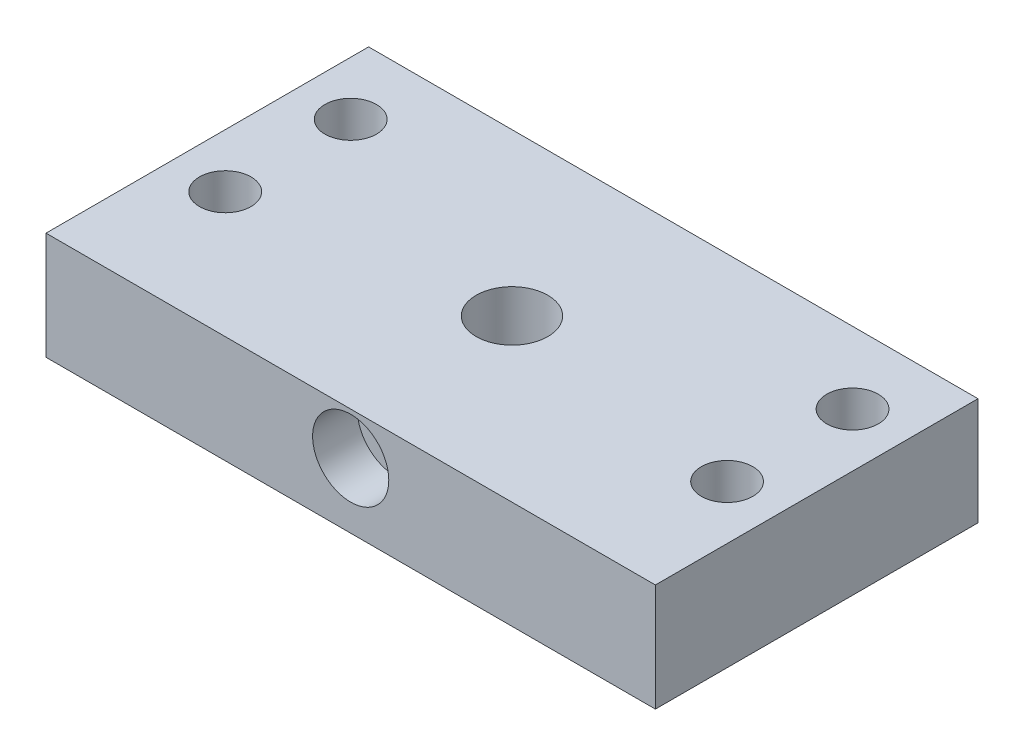
ISO-10303-21;
HEADER;
FILE_DESCRIPTION(('STEP AP214'),'2;1');
FILE_NAME('part.step','',(''),(''),'','','');
FILE_SCHEMA(('AUTOMOTIVE_DESIGN { 1 0 10303 214 1 1 1 1 }'));
ENDSEC;
DATA;
#1=APPLICATION_CONTEXT('core data for automotive mechanical design processes');
#2=APPLICATION_PROTOCOL_DEFINITION('international standard','automotive_design',2000,#1);
#3=PRODUCT_CONTEXT('',#1,'mechanical');
#4=PRODUCT('Part','Part','',(#3));
#5=PRODUCT_RELATED_PRODUCT_CATEGORY('part','',(#4));
#6=PRODUCT_DEFINITION_FORMATION('','',#4);
#7=PRODUCT_DEFINITION_CONTEXT('part definition',#1,'design');
#8=PRODUCT_DEFINITION('design','',#6,#7);
#9=PRODUCT_DEFINITION_SHAPE('','',#8);
#10=(LENGTH_UNIT() NAMED_UNIT(*) SI_UNIT(.MILLI.,.METRE.));
#11=(NAMED_UNIT(*) PLANE_ANGLE_UNIT() SI_UNIT($,.RADIAN.));
#12=(NAMED_UNIT(*) SI_UNIT($,.STERADIAN.) SOLID_ANGLE_UNIT());
#13=UNCERTAINTY_MEASURE_WITH_UNIT(LENGTH_MEASURE(1.E-05),#10,'distance_accuracy_value','');
#14=(GEOMETRIC_REPRESENTATION_CONTEXT(3) GLOBAL_UNCERTAINTY_ASSIGNED_CONTEXT((#13)) GLOBAL_UNIT_ASSIGNED_CONTEXT((#10,
#11,#12)) REPRESENTATION_CONTEXT('',''));
#15=CARTESIAN_POINT('',(0.,0.,0.));
#16=DIRECTION('',(0.,0.,1.));
#17=DIRECTION('',(1.,0.,0.));
#18=AXIS2_PLACEMENT_3D('',#15,#16,#17);
#19=CARTESIAN_POINT('',(0.,7.25,-18.001));
#20=DIRECTION('',(0.,0.,1.));
#21=DIRECTION('',(1.,0.,0.));
#22=AXIS2_PLACEMENT_3D('',#19,#20,#21);
#23=CYLINDRICAL_SURFACE('',#22,2.375);
#24=CARTESIAN_POINT('',(2.375,7.25,3.21859829739593));
#25=CARTESIAN_POINT('',(2.37500399921893,7.13019269672055,3.21859274203493));
#26=CARTESIAN_POINT('',(2.36587916323024,7.01040546905748,3.22538771653776));
#27=CARTESIAN_POINT('',(2.33003608146432,6.77483578789484,3.25136918584233));
#28=CARTESIAN_POINT('',(2.30329972694586,6.65905758571992,3.27056843473602));
#29=CARTESIAN_POINT('',(2.23399044613364,6.43541822919312,3.31828566284373));
#30=CARTESIAN_POINT('',(2.19152909658383,6.32750755769919,3.34673781872815));
#31=CARTESIAN_POINT('',(2.09232949271277,6.12040677269594,3.40963366185724));
#32=CARTESIAN_POINT('',(2.03558681798399,6.02121937209587,3.44407920317544));
#33=CARTESIAN_POINT('',(1.90153009389591,5.82137690949876,3.52005631808132));
#34=CARTESIAN_POINT('',(1.82256840644108,5.72196179983823,3.5619428373468));
#35=CARTESIAN_POINT('',(1.64969504355961,5.53675966426523,3.64523320979023));
#36=CARTESIAN_POINT('',(1.55577253548869,5.45098260383914,3.68663668972149));
#37=CARTESIAN_POINT('',(1.34367485162625,5.28658721904273,3.76945679722964));
#38=CARTESIAN_POINT('',(1.22398860493031,5.20966645665209,3.81041826206638));
#39=CARTESIAN_POINT('',(0.970479402420635,5.07763722656182,3.88271570681444));
#40=CARTESIAN_POINT('',(0.836669263450686,5.02250919484508,3.91406031439345));
#41=CARTESIAN_POINT('',(0.571987570331598,4.94115171626473,3.96095464121703));
#42=CARTESIAN_POINT('',(0.442020032298662,4.91269466982756,3.97771118078781));
#43=CARTESIAN_POINT('',(0.178184244819338,4.87796920586672,3.99821176000784));
#44=CARTESIAN_POINT('',(0.0443196737403946,4.87168050740931,4.00196769333412));
#45=CARTESIAN_POINT('',(-0.20597385257549,4.8810442937401,3.99641448212983));
#46=CARTESIAN_POINT('',(-0.322545044730626,4.89412369499521,3.98863733729226));
#47=CARTESIAN_POINT('',(-0.551483940371612,4.93698207474324,3.96347391279008));
#48=CARTESIAN_POINT('',(-0.663851332351829,4.96676228817814,3.94608692252657));
#49=CARTESIAN_POINT('',(-0.882347185133233,5.04193824704594,3.90307041352531));
#50=CARTESIAN_POINT('',(-0.98843009675314,5.08743472665091,3.87738779425803));
#51=CARTESIAN_POINT('',(-1.1915967959663,5.19237774738527,3.81985085065154));
#52=CARTESIAN_POINT('',(-1.28867816568337,5.25182802154397,3.78799487516567));
#53=CARTESIAN_POINT('',(-1.48337363486101,5.39091807141468,3.71639460765003));
#54=CARTESIAN_POINT('',(-1.57969649287139,5.47211306649521,3.6761630184736));
#55=CARTESIAN_POINT('',(-1.75816707389297,5.64836524176809,3.59423359110488));
#56=CARTESIAN_POINT('',(-1.84029570284407,5.74344078193277,3.55253386730505));
#57=CARTESIAN_POINT('',(-1.99735001326313,5.95742079208189,3.46690790060612));
#58=CARTESIAN_POINT('',(-2.07043180286397,6.07780215349926,3.42325729898975));
#59=CARTESIAN_POINT('',(-2.19490642645885,6.33188923753022,3.34482142789895));
#60=CARTESIAN_POINT('',(-2.24633900478084,6.46556998171544,3.3100199598304));
#61=CARTESIAN_POINT('',(-2.31514079416325,6.70905080291436,3.26212076962811));
#62=CARTESIAN_POINT('',(-2.33775606816076,6.81673415984444,3.2458010171099));
#63=CARTESIAN_POINT('',(-2.36783056608336,7.03522687932263,3.22393270128734));
#64=CARTESIAN_POINT('',(-2.37530669862908,7.14603261408898,3.21837212157576));
#65=CARTESIAN_POINT('',(-2.37467345051733,7.36770087015217,3.21883912092991));
#66=CARTESIAN_POINT('',(-2.36654550170154,7.47856330196957,3.22488050581689));
#67=CARTESIAN_POINT('',(-2.33516575464101,7.69701888440702,3.24767009167096));
#68=CARTESIAN_POINT('',(-2.31190218915793,7.80460942310127,3.26442662299236));
#69=CARTESIAN_POINT('',(-2.25135151160707,8.01418387832866,3.30647252374685));
#70=CARTESIAN_POINT('',(-2.21403521973313,8.11615561913966,3.33177963673067));
#71=CARTESIAN_POINT('',(-2.12668668997642,8.3127387051287,3.38820052053147));
#72=CARTESIAN_POINT('',(-2.0766495711049,8.4073472067865,3.41931651900089));
#73=CARTESIAN_POINT('',(-1.95503621600254,8.60429875500901,3.49050531762543));
#74=CARTESIAN_POINT('',(-1.88121366890389,8.70503666116637,3.53118782259871));
#75=CARTESIAN_POINT('',(-1.71881564621432,8.89371937289048,3.61302584821871));
#76=CARTESIAN_POINT('',(-1.63022643115858,8.98165211994554,3.6541817758414));
#77=CARTESIAN_POINT('',(-1.42774937279771,9.15311292773089,3.73831045191109));
#78=CARTESIAN_POINT('',(-1.31208997910011,9.23476824317186,3.78088381887895));
#79=CARTESIAN_POINT('',(-1.06594140172161,9.37710077352837,3.85750389130317));
#80=CARTESIAN_POINT('',(-0.935462670333445,9.4377926536535,3.89155655290147));
#81=CARTESIAN_POINT('',(-0.673461271000761,9.53143356169658,3.94499073924787));
#82=CARTESIAN_POINT('',(-0.542753057087998,9.5661239131019,3.9652820798713));
#83=CARTESIAN_POINT('',(-0.276041317654081,9.61277295252532,3.99270610285033));
#84=CARTESIAN_POINT('',(-0.140043639752832,9.62475605369247,3.99985291698113));
#85=CARTESIAN_POINT('',(0.11428081976659,9.62520580674378,4.00012414727652));
#86=CARTESIAN_POINT('',(0.232612825204316,9.61651971608736,3.99494630163883));
#87=CARTESIAN_POINT('',(0.465804396706108,9.58185376675745,3.97450872268908));
#88=CARTESIAN_POINT('',(0.580663886631354,9.55587352917737,3.95924876848283));
#89=CARTESIAN_POINT('',(0.802570773351388,9.48826152682534,3.9202603013208));
#90=CARTESIAN_POINT('',(0.909694426450307,9.4468182800975,3.89663395752156));
#91=CARTESIAN_POINT('',(1.11551347833263,9.34981213784586,3.84278029354569));
#92=CARTESIAN_POINT('',(1.21420690422523,9.29424594921894,3.81255143406548));
#93=CARTESIAN_POINT('',(1.41197270878366,9.16376263421425,3.74412094514629));
#94=CARTESIAN_POINT('',(1.50990963173195,9.08739500797667,3.70540916048651));
#95=CARTESIAN_POINT('',(1.69235100288208,8.92088475241084,3.62572491802193));
#96=CARTESIAN_POINT('',(1.77683990172037,8.83072641021238,3.58474991601283));
#97=CARTESIAN_POINT('',(1.94054997146781,8.62625528073629,3.49911361847173));
#98=CARTESIAN_POINT('',(2.01786624821418,8.51033717977594,3.45461361348632));
#99=CARTESIAN_POINT('',(2.15183027799257,8.26477401369631,3.37280396876143));
#100=CARTESIAN_POINT('',(2.2084946788526,8.13514011438158,3.33548854890452));
#101=CARTESIAN_POINT('',(2.29307696478757,7.88098795254745,3.2778228551022));
#102=CARTESIAN_POINT('',(2.32361169112555,7.75769403019723,3.25598298398031));
#103=CARTESIAN_POINT('',(2.36455269660588,7.50625288753691,3.22638653027499));
#104=CARTESIAN_POINT('',(2.37499572346775,7.37811496561476,3.21860423797605));
#105=CARTESIAN_POINT('',(2.375,7.25,3.21859829739593));
#106=B_SPLINE_CURVE_WITH_KNOTS('',3,(#24,#25,#26,#27,#28,#29,#30,#31,#32,#33,#34,#35,#36,#37,
#38,#39,#40,#41,#42,#43,#44,#45,#46,#47,#48,#49,#50,#51,#52,#53,#54,#55,#56,#57,#58,#59,#60,#61,
#62,#63,#64,#65,#66,#67,#68,#69,#70,#71,#72,#73,#74,#75,#76,#77,#78,#79,#80,#81,#82,#83,#84,#85,
#86,#87,#88,#89,#90,#91,#92,#93,#94,#95,#96,#97,#98,#99,#100,#101,#102,#103,#104,#105),
.UNSPECIFIED.,.T.,.F.,(4,2,2,2,2,2,2,2,2,2,2,2,2,2,2,2,2,2,2,2,2,2,2,2,2,2,2,2,2,2,2,2,2,2,2,2,
2,2,2,2,4),(0.,0.358885040976135,0.718139676564717,1.07489259104103,1.43175606506433,
1.83124734109027,2.2310292017523,2.67279137544207,3.11415605983443,3.51407427068365,
3.91362651728914,4.26463189155495,4.615663224345,4.96898758947828,5.32240658669213,
5.71756600452525,6.11325292146195,6.55336395272599,6.99266345219662,7.32493567633687,
7.65683658677772,7.98913268925771,8.32168744571811,8.65493657804029,8.98831377174795,
9.3808301079571,9.77371371589547,10.2149315789879,10.6558401549854,11.063633228013,
11.4709876229129,11.8255330068348,12.1800861589346,12.5304509508889,12.8808975138792,
13.2696120767269,13.6587728785156,14.0954819012814,14.5318381027416,14.9163127784477,
15.3000835789394),.UNSPECIFIED.);
#107=CARTESIAN_POINT('',(2.375,7.25,3.21859829739593));
#108=VERTEX_POINT('',#107);
#109=EDGE_CURVE('E144',#108,#108,#106,.T.);
#110=ORIENTED_EDGE('',*,*,#109,.T.);
#111=EDGE_LOOP('',(#110));
#112=FACE_BOUND('',#111,.T.);
#113=CARTESIAN_POINT('',(0.,7.25,13.));
#114=DIRECTION('',(0.,0.,1.));
#115=DIRECTION('',(1.,0.,0.));
#116=AXIS2_PLACEMENT_3D('',#113,#114,#115);
#117=CIRCLE('',#116,2.375);
#118=CARTESIAN_POINT('',(2.375,7.25,13.));
#119=VERTEX_POINT('',#118);
#120=EDGE_CURVE('E41',#119,#119,#117,.F.);
#121=ORIENTED_EDGE('',*,*,#120,.F.);
#122=EDGE_LOOP('',(#121));
#123=FACE_BOUND('',#122,.T.);
#124=ADVANCED_FACE('F37',(#112,#123),#23,.F.);
#125=CARTESIAN_POINT('',(28.,12.001,4.));
#126=DIRECTION('',(0.,-1.,0.));
#127=DIRECTION('',(0.,0.,-1.));
#128=AXIS2_PLACEMENT_3D('',#125,#126,#127);
#129=CYLINDRICAL_SURFACE('',#128,2.875);
#130=CARTESIAN_POINT('',(28.,12.,4.));
#131=DIRECTION('',(0.,-1.,0.));
#132=DIRECTION('',(0.,0.,-1.));
#133=AXIS2_PLACEMENT_3D('',#130,#131,#132);
#134=CIRCLE('',#133,2.875);
#135=CARTESIAN_POINT('',(28.,12.,1.125));
#136=VERTEX_POINT('',#135);
#137=EDGE_CURVE('E140',#136,#136,#134,.F.);
#138=ORIENTED_EDGE('',*,*,#137,.T.);
#139=EDGE_LOOP('',(#138));
#140=FACE_BOUND('',#139,.T.);
#141=CARTESIAN_POINT('',(28.,6.,4.));
#142=DIRECTION('',(0.,-1.,0.));
#143=DIRECTION('',(0.,0.,-1.));
#144=AXIS2_PLACEMENT_3D('',#141,#142,#143);
#145=CIRCLE('',#144,2.875);
#146=CARTESIAN_POINT('',(28.,6.,1.125));
#147=VERTEX_POINT('',#146);
#148=EDGE_CURVE('E122',#147,#147,#145,.F.);
#149=ORIENTED_EDGE('',*,*,#148,.F.);
#150=EDGE_LOOP('',(#149));
#151=FACE_BOUND('',#150,.T.);
#152=ADVANCED_FACE('F159',(#140,#151),#129,.F.);
#153=CARTESIAN_POINT('',(-28.,12.001,-10.));
#154=DIRECTION('',(0.,-1.,0.));
#155=DIRECTION('',(0.,0.,-1.));
#156=AXIS2_PLACEMENT_3D('',#153,#154,#155);
#157=CYLINDRICAL_SURFACE('',#156,2.875);
#158=CARTESIAN_POINT('',(-28.,12.,-10.));
#159=DIRECTION('',(0.,-1.,0.));
#160=DIRECTION('',(0.,0.,-1.));
#161=AXIS2_PLACEMENT_3D('',#158,#159,#160);
#162=CIRCLE('',#161,2.875);
#163=CARTESIAN_POINT('',(-28.,12.,-12.875));
#164=VERTEX_POINT('',#163);
#165=EDGE_CURVE('E124',#164,#164,#162,.F.);
#166=ORIENTED_EDGE('',*,*,#165,.T.);
#167=EDGE_LOOP('',(#166));
#168=FACE_BOUND('',#167,.T.);
#169=CARTESIAN_POINT('',(-28.,6.,-10.));
#170=DIRECTION('',(0.,-1.,0.));
#171=DIRECTION('',(0.,0.,-1.));
#172=AXIS2_PLACEMENT_3D('',#169,#170,#171);
#173=CIRCLE('',#172,2.875);
#174=CARTESIAN_POINT('',(-28.,6.,-12.875));
#175=VERTEX_POINT('',#174);
#176=EDGE_CURVE('E120',#175,#175,#173,.F.);
#177=ORIENTED_EDGE('',*,*,#176,.F.);
#178=EDGE_LOOP('',(#177));
#179=FACE_BOUND('',#178,.T.);
#180=ADVANCED_FACE('F162',(#168,#179),#157,.F.);
#181=CARTESIAN_POINT('',(-28.,12.001,4.));
#182=DIRECTION('',(0.,-1.,0.));
#183=DIRECTION('',(0.,0.,-1.));
#184=AXIS2_PLACEMENT_3D('',#181,#182,#183);
#185=CYLINDRICAL_SURFACE('',#184,2.875);
#186=CARTESIAN_POINT('',(-28.,12.,4.));
#187=DIRECTION('',(0.,-1.,0.));
#188=DIRECTION('',(0.,0.,-1.));
#189=AXIS2_PLACEMENT_3D('',#186,#187,#188);
#190=CIRCLE('',#189,2.875);
#191=CARTESIAN_POINT('',(-28.,12.,1.125));
#192=VERTEX_POINT('',#191);
#193=EDGE_CURVE('E128',#192,#192,#190,.F.);
#194=ORIENTED_EDGE('',*,*,#193,.T.);
#195=EDGE_LOOP('',(#194));
#196=FACE_BOUND('',#195,.T.);
#197=CARTESIAN_POINT('',(-28.,6.,4.));
#198=DIRECTION('',(0.,-1.,0.));
#199=DIRECTION('',(0.,0.,-1.));
#200=AXIS2_PLACEMENT_3D('',#197,#198,#199);
#201=CIRCLE('',#200,2.875);
#202=CARTESIAN_POINT('',(-28.,6.,1.125));
#203=VERTEX_POINT('',#202);
#204=EDGE_CURVE('E116',#203,#203,#201,.F.);
#205=ORIENTED_EDGE('',*,*,#204,.F.);
#206=EDGE_LOOP('',(#205));
#207=FACE_BOUND('',#206,.T.);
#208=ADVANCED_FACE('F164',(#196,#207),#185,.F.);
#209=CARTESIAN_POINT('',(28.,12.001,-10.));
#210=DIRECTION('',(0.,-1.,0.));
#211=DIRECTION('',(0.,0.,-1.));
#212=AXIS2_PLACEMENT_3D('',#209,#210,#211);
#213=CYLINDRICAL_SURFACE('',#212,2.875);
#214=CARTESIAN_POINT('',(28.,12.,-10.));
#215=DIRECTION('',(0.,-1.,0.));
#216=DIRECTION('',(0.,0.,-1.));
#217=AXIS2_PLACEMENT_3D('',#214,#215,#216);
#218=CIRCLE('',#217,2.875);
#219=CARTESIAN_POINT('',(28.,12.,-12.875));
#220=VERTEX_POINT('',#219);
#221=EDGE_CURVE('E133',#220,#220,#218,.F.);
#222=ORIENTED_EDGE('',*,*,#221,.T.);
#223=EDGE_LOOP('',(#222));
#224=FACE_BOUND('',#223,.T.);
#225=CARTESIAN_POINT('',(28.,6.,-10.));
#226=DIRECTION('',(0.,-1.,0.));
#227=DIRECTION('',(0.,0.,-1.));
#228=AXIS2_PLACEMENT_3D('',#225,#226,#227);
#229=CIRCLE('',#228,2.875);
#230=CARTESIAN_POINT('',(28.,6.,-12.875));
#231=VERTEX_POINT('',#230);
#232=EDGE_CURVE('E113',#231,#231,#229,.F.);
#233=ORIENTED_EDGE('',*,*,#232,.F.);
#234=EDGE_LOOP('',(#233));
#235=FACE_BOUND('',#234,.T.);
#236=ADVANCED_FACE('F167',(#224,#235),#213,.F.);
#237=CARTESIAN_POINT('',(34.,12.,18.));
#238=DIRECTION('',(-1.,0.,0.));
#239=DIRECTION('',(0.,0.,1.));
#240=AXIS2_PLACEMENT_3D('',#237,#238,#239);
#241=PLANE('',#240);
#242=DIRECTION('',(0.,0.,-1.));
#243=VECTOR('',#242,1.);
#244=CARTESIAN_POINT('',(34.,0.,18.));
#245=LINE('',#244,#243);
#246=CARTESIAN_POINT('',(34.,0.,18.));
#247=VERTEX_POINT('',#246);
#248=CARTESIAN_POINT('',(34.,0.,-18.));
#249=VERTEX_POINT('',#248);
#250=EDGE_CURVE('E104',#247,#249,#245,.T.);
#251=ORIENTED_EDGE('',*,*,#250,.T.);
#252=DIRECTION('',(0.,-1.,0.));
#253=VECTOR('',#252,1.);
#254=CARTESIAN_POINT('',(34.,12.,-18.));
#255=LINE('',#254,#253);
#256=CARTESIAN_POINT('',(34.,12.,-18.));
#257=VERTEX_POINT('',#256);
#258=EDGE_CURVE('E11',#257,#249,#255,.T.);
#259=ORIENTED_EDGE('',*,*,#258,.F.);
#260=DIRECTION('',(0.,0.,-1.));
#261=VECTOR('',#260,1.);
#262=CARTESIAN_POINT('',(34.,12.,18.));
#263=LINE('',#262,#261);
#264=CARTESIAN_POINT('',(34.,12.,18.));
#265=VERTEX_POINT('',#264);
#266=EDGE_CURVE('E91',#265,#257,#263,.T.);
#267=ORIENTED_EDGE('',*,*,#266,.F.);
#268=DIRECTION('',(0.,-1.,0.));
#269=VECTOR('',#268,1.);
#270=CARTESIAN_POINT('',(34.,12.,18.));
#271=LINE('',#270,#269);
#272=EDGE_CURVE('E100',#265,#247,#271,.T.);
#273=ORIENTED_EDGE('',*,*,#272,.T.);
#274=EDGE_LOOP('',(#251,#259,#267,#273));
#275=FACE_BOUND('',#274,.T.);
#276=ADVANCED_FACE('F39',(#275),#241,.F.);
#277=CARTESIAN_POINT('',(-34.,12.,-18.));
#278=DIRECTION('',(0.,0.,1.));
#279=DIRECTION('',(1.,0.,0.));
#280=AXIS2_PLACEMENT_3D('',#277,#278,#279);
#281=PLANE('',#280);
#282=DIRECTION('',(-1.,0.,0.));
#283=VECTOR('',#282,1.);
#284=CARTESIAN_POINT('',(-34.,0.,-18.));
#285=LINE('',#284,#283);
#286=CARTESIAN_POINT('',(-34.,0.,-18.));
#287=VERTEX_POINT('',#286);
#288=EDGE_CURVE('E95',#249,#287,#285,.T.);
#289=ORIENTED_EDGE('',*,*,#288,.T.);
#290=DIRECTION('',(0.,-1.,0.));
#291=VECTOR('',#290,1.);
#292=CARTESIAN_POINT('',(-34.,12.,-18.));
#293=LINE('',#292,#291);
#294=CARTESIAN_POINT('',(-34.,12.,-18.));
#295=VERTEX_POINT('',#294);
#296=EDGE_CURVE('E47',#295,#287,#293,.T.);
#297=ORIENTED_EDGE('',*,*,#296,.F.);
#298=DIRECTION('',(-1.,0.,0.));
#299=VECTOR('',#298,1.);
#300=CARTESIAN_POINT('',(-34.,12.,-18.));
#301=LINE('',#300,#299);
#302=EDGE_CURVE('E86',#257,#295,#301,.T.);
#303=ORIENTED_EDGE('',*,*,#302,.F.);
#304=ORIENTED_EDGE('',*,*,#258,.T.);
#305=EDGE_LOOP('',(#289,#297,#303,#304));
#306=FACE_BOUND('',#305,.T.);
#307=ADVANCED_FACE('F94',(#306),#281,.F.);
#308=CARTESIAN_POINT('',(-34.,12.,18.));
#309=DIRECTION('',(1.,0.,0.));
#310=DIRECTION('',(0.,0.,-1.));
#311=AXIS2_PLACEMENT_3D('',#308,#309,#310);
#312=PLANE('',#311);
#313=DIRECTION('',(0.,0.,1.));
#314=VECTOR('',#313,1.);
#315=CARTESIAN_POINT('',(-34.,0.,18.));
#316=LINE('',#315,#314);
#317=CARTESIAN_POINT('',(-34.,0.,18.));
#318=VERTEX_POINT('',#317);
#319=EDGE_CURVE('E73',#287,#318,#316,.T.);
#320=ORIENTED_EDGE('',*,*,#319,.T.);
#321=DIRECTION('',(0.,-1.,0.));
#322=VECTOR('',#321,1.);
#323=CARTESIAN_POINT('',(-34.,12.,18.));
#324=LINE('',#323,#322);
#325=CARTESIAN_POINT('',(-34.,12.,18.));
#326=VERTEX_POINT('',#325);
#327=EDGE_CURVE('E96',#326,#318,#324,.T.);
#328=ORIENTED_EDGE('',*,*,#327,.F.);
#329=DIRECTION('',(0.,0.,1.));
#330=VECTOR('',#329,1.);
#331=CARTESIAN_POINT('',(-34.,12.,18.));
#332=LINE('',#331,#330);
#333=EDGE_CURVE('E89',#295,#326,#332,.T.);
#334=ORIENTED_EDGE('',*,*,#333,.F.);
#335=ORIENTED_EDGE('',*,*,#296,.T.);
#336=EDGE_LOOP('',(#320,#328,#334,#335));
#337=FACE_BOUND('',#336,.T.);
#338=ADVANCED_FACE('F98',(#337),#312,.F.);
#339=CARTESIAN_POINT('',(-34.,12.,18.));
#340=DIRECTION('',(0.,0.,-1.));
#341=DIRECTION('',(-1.,0.,0.));
#342=AXIS2_PLACEMENT_3D('',#339,#340,#341);
#343=PLANE('',#342);
#344=CARTESIAN_POINT('',(0.,7.25,18.));
#345=DIRECTION('',(0.,0.,1.));
#346=DIRECTION('',(1.,0.,0.));
#347=AXIS2_PLACEMENT_3D('',#344,#345,#346);
#348=CIRCLE('',#347,4.25);
#349=CARTESIAN_POINT('',(4.25,7.25,18.));
#350=VERTEX_POINT('',#349);
#351=EDGE_CURVE('E231',#350,#350,#348,.T.);
#352=ORIENTED_EDGE('',*,*,#351,.F.);
#353=EDGE_LOOP('',(#352));
#354=FACE_BOUND('',#353,.T.);
#355=DIRECTION('',(1.,0.,0.));
#356=VECTOR('',#355,1.);
#357=CARTESIAN_POINT('',(-34.,0.,18.));
#358=LINE('',#357,#356);
#359=EDGE_CURVE('E79',#318,#247,#358,.T.);
#360=ORIENTED_EDGE('',*,*,#359,.T.);
#361=ORIENTED_EDGE('',*,*,#272,.F.);
#362=DIRECTION('',(1.,0.,0.));
#363=VECTOR('',#362,1.);
#364=CARTESIAN_POINT('',(-34.,12.,18.));
#365=LINE('',#364,#363);
#366=EDGE_CURVE('E56',#326,#265,#365,.T.);
#367=ORIENTED_EDGE('',*,*,#366,.F.);
#368=ORIENTED_EDGE('',*,*,#327,.T.);
#369=EDGE_LOOP('',(#360,#361,#367,#368));
#370=FACE_BOUND('',#369,.T.);
#371=ADVANCED_FACE('F268',(#354,#370),#343,.F.);
#372=CARTESIAN_POINT('',(0.,12.,0.));
#373=DIRECTION('',(0.,-1.,0.));
#374=DIRECTION('',(0.,0.,-1.));
#375=AXIS2_PLACEMENT_3D('',#372,#373,#374);
#376=PLANE('',#375);
#377=ORIENTED_EDGE('',*,*,#221,.F.);
#378=EDGE_LOOP('',(#377));
#379=FACE_BOUND('',#378,.T.);
#380=ORIENTED_EDGE('',*,*,#193,.F.);
#381=EDGE_LOOP('',(#380));
#382=FACE_BOUND('',#381,.T.);
#383=ORIENTED_EDGE('',*,*,#165,.F.);
#384=EDGE_LOOP('',(#383));
#385=FACE_BOUND('',#384,.T.);
#386=ORIENTED_EDGE('',*,*,#137,.F.);
#387=EDGE_LOOP('',(#386));
#388=FACE_BOUND('',#387,.T.);
#389=CARTESIAN_POINT('',(0.,12.,0.));
#390=DIRECTION('',(0.,-1.,0.));
#391=DIRECTION('',(0.,0.,-1.));
#392=AXIS2_PLACEMENT_3D('',#389,#390,#391);
#393=CIRCLE('',#392,4.);
#394=CARTESIAN_POINT('',(0.,12.,-4.));
#395=VERTEX_POINT('',#394);
#396=EDGE_CURVE('E153',#395,#395,#393,.T.);
#397=ORIENTED_EDGE('',*,*,#396,.T.);
#398=EDGE_LOOP('',(#397));
#399=FACE_BOUND('',#398,.T.);
#400=ORIENTED_EDGE('',*,*,#266,.T.);
#401=ORIENTED_EDGE('',*,*,#302,.T.);
#402=ORIENTED_EDGE('',*,*,#333,.T.);
#403=ORIENTED_EDGE('',*,*,#366,.T.);
#404=EDGE_LOOP('',(#400,#401,#402,#403));
#405=FACE_BOUND('',#404,.T.);
#406=ADVANCED_FACE('F87',(#379,#382,#385,#388,#399,#405),#376,.F.);
#407=CARTESIAN_POINT('',(0.,0.,0.));
#408=DIRECTION('',(0.,-1.,0.));
#409=DIRECTION('',(0.,0.,-1.));
#410=AXIS2_PLACEMENT_3D('',#407,#408,#409);
#411=PLANE('',#410);
#412=CARTESIAN_POINT('',(-28.,0.,-10.));
#413=DIRECTION('',(0.,-1.,0.));
#414=DIRECTION('',(0.,0.,-1.));
#415=AXIS2_PLACEMENT_3D('',#412,#413,#414);
#416=CIRCLE('',#415,5.);
#417=CARTESIAN_POINT('',(-28.,0.,-15.));
#418=VERTEX_POINT('',#417);
#419=EDGE_CURVE('E226',#418,#418,#416,.T.);
#420=ORIENTED_EDGE('',*,*,#419,.F.);
#421=EDGE_LOOP('',(#420));
#422=FACE_BOUND('',#421,.T.);
#423=CARTESIAN_POINT('',(28.,0.,-10.));
#424=DIRECTION('',(0.,-1.,0.));
#425=DIRECTION('',(0.,0.,-1.));
#426=AXIS2_PLACEMENT_3D('',#423,#424,#425);
#427=CIRCLE('',#426,5.);
#428=CARTESIAN_POINT('',(28.,0.,-15.));
#429=VERTEX_POINT('',#428);
#430=EDGE_CURVE('E246',#429,#429,#427,.T.);
#431=ORIENTED_EDGE('',*,*,#430,.F.);
#432=EDGE_LOOP('',(#431));
#433=FACE_BOUND('',#432,.T.);
#434=CARTESIAN_POINT('',(28.,0.,4.));
#435=DIRECTION('',(0.,-1.,0.));
#436=DIRECTION('',(0.,0.,-1.));
#437=AXIS2_PLACEMENT_3D('',#434,#435,#436);
#438=CIRCLE('',#437,5.);
#439=CARTESIAN_POINT('',(28.,0.,-0.999999999999996));
#440=VERTEX_POINT('',#439);
#441=EDGE_CURVE('E240',#440,#440,#438,.T.);
#442=ORIENTED_EDGE('',*,*,#441,.F.);
#443=EDGE_LOOP('',(#442));
#444=FACE_BOUND('',#443,.T.);
#445=CARTESIAN_POINT('',(-28.,0.,4.));
#446=DIRECTION('',(0.,-1.,0.));
#447=DIRECTION('',(0.,0.,-1.));
#448=AXIS2_PLACEMENT_3D('',#445,#446,#447);
#449=CIRCLE('',#448,5.);
#450=CARTESIAN_POINT('',(-28.,0.,-0.999999999999999));
#451=VERTEX_POINT('',#450);
#452=EDGE_CURVE('E137',#451,#451,#449,.T.);
#453=ORIENTED_EDGE('',*,*,#452,.F.);
#454=EDGE_LOOP('',(#453));
#455=FACE_BOUND('',#454,.T.);
#456=CARTESIAN_POINT('',(0.,0.,0.));
#457=DIRECTION('',(0.,-1.,0.));
#458=DIRECTION('',(0.,0.,-1.));
#459=AXIS2_PLACEMENT_3D('',#456,#457,#458);
#460=CIRCLE('',#459,11.);
#461=CARTESIAN_POINT('',(0.,0.,-11.));
#462=VERTEX_POINT('',#461);
#463=EDGE_CURVE('E265',#462,#462,#460,.T.);
#464=ORIENTED_EDGE('',*,*,#463,.F.);
#465=EDGE_LOOP('',(#464));
#466=FACE_BOUND('',#465,.T.);
#467=ORIENTED_EDGE('',*,*,#250,.F.);
#468=ORIENTED_EDGE('',*,*,#359,.F.);
#469=ORIENTED_EDGE('',*,*,#319,.F.);
#470=ORIENTED_EDGE('',*,*,#288,.F.);
#471=EDGE_LOOP('',(#467,#468,#469,#470));
#472=FACE_BOUND('',#471,.T.);
#473=ADVANCED_FACE('F256',(#422,#433,#444,#455,#466,#472),#411,.T.);
#474=CARTESIAN_POINT('',(0.,4.,0.));
#475=DIRECTION('',(0.,-1.,0.));
#476=DIRECTION('',(0.,0.,-1.));
#477=AXIS2_PLACEMENT_3D('',#474,#475,#476);
#478=CYLINDRICAL_SURFACE('',#477,11.);
#479=CARTESIAN_POINT('',(0.,4.,0.));
#480=DIRECTION('',(0.,-1.,0.));
#481=DIRECTION('',(0.,0.,-1.));
#482=AXIS2_PLACEMENT_3D('',#479,#480,#481);
#483=CIRCLE('',#482,11.);
#484=CARTESIAN_POINT('',(0.,4.,-11.));
#485=VERTEX_POINT('',#484);
#486=EDGE_CURVE('E107',#485,#485,#483,.T.);
#487=ORIENTED_EDGE('',*,*,#486,.F.);
#488=EDGE_LOOP('',(#487));
#489=FACE_BOUND('',#488,.T.);
#490=ORIENTED_EDGE('',*,*,#463,.T.);
#491=EDGE_LOOP('',(#490));
#492=FACE_BOUND('',#491,.T.);
#493=ADVANCED_FACE('F259',(#489,#492),#478,.F.);
#494=CARTESIAN_POINT('',(0.,4.,0.));
#495=DIRECTION('',(0.,-1.,0.));
#496=DIRECTION('',(0.,0.,-1.));
#497=AXIS2_PLACEMENT_3D('',#494,#495,#496);
#498=PLANE('',#497);
#499=CARTESIAN_POINT('',(0.,4.,0.));
#500=DIRECTION('',(0.,-1.,0.));
#501=DIRECTION('',(0.,0.,-1.));
#502=AXIS2_PLACEMENT_3D('',#499,#500,#501);
#503=CIRCLE('',#502,4.);
#504=CARTESIAN_POINT('',(0.,4.,-4.));
#505=VERTEX_POINT('',#504);
#506=EDGE_CURVE('E152',#505,#505,#503,.T.);
#507=ORIENTED_EDGE('',*,*,#506,.F.);
#508=EDGE_LOOP('',(#507));
#509=FACE_BOUND('',#508,.T.);
#510=ORIENTED_EDGE('',*,*,#486,.T.);
#511=EDGE_LOOP('',(#510));
#512=FACE_BOUND('',#511,.T.);
#513=ADVANCED_FACE('F321',(#509,#512),#498,.T.);
#514=CARTESIAN_POINT('',(0.,12.,0.));
#515=DIRECTION('',(0.,-1.,0.));
#516=DIRECTION('',(0.,0.,-1.));
#517=AXIS2_PLACEMENT_3D('',#514,#515,#516);
#518=CYLINDRICAL_SURFACE('',#517,4.);
#519=ORIENTED_EDGE('',*,*,#109,.F.);
#520=EDGE_LOOP('',(#519));
#521=FACE_BOUND('',#520,.T.);
#522=ORIENTED_EDGE('',*,*,#396,.F.);
#523=EDGE_LOOP('',(#522));
#524=FACE_BOUND('',#523,.T.);
#525=ORIENTED_EDGE('',*,*,#506,.T.);
#526=EDGE_LOOP('',(#525));
#527=FACE_BOUND('',#526,.T.);
#528=ADVANCED_FACE('F198',(#521,#524,#527),#518,.F.);
#529=CARTESIAN_POINT('',(28.,6.,-10.));
#530=DIRECTION('',(0.,-1.,0.));
#531=DIRECTION('',(0.,0.,-1.));
#532=AXIS2_PLACEMENT_3D('',#529,#530,#531);
#533=PLANE('',#532);
#534=CARTESIAN_POINT('',(28.,6.,-10.));
#535=DIRECTION('',(0.,-1.,0.));
#536=DIRECTION('',(0.,0.,-1.));
#537=AXIS2_PLACEMENT_3D('',#534,#535,#536);
#538=CIRCLE('',#537,5.);
#539=CARTESIAN_POINT('',(28.,6.,-15.));
#540=VERTEX_POINT('',#539);
#541=EDGE_CURVE('E243',#540,#540,#538,.T.);
#542=ORIENTED_EDGE('',*,*,#541,.T.);
#543=EDGE_LOOP('',(#542));
#544=FACE_BOUND('',#543,.T.);
#545=ORIENTED_EDGE('',*,*,#232,.T.);
#546=EDGE_LOOP('',(#545));
#547=FACE_BOUND('',#546,.T.);
#548=ADVANCED_FACE('F194',(#544,#547),#533,.T.);
#549=CARTESIAN_POINT('',(28.,6.,-10.));
#550=DIRECTION('',(0.,-1.,0.));
#551=DIRECTION('',(0.,0.,-1.));
#552=AXIS2_PLACEMENT_3D('',#549,#550,#551);
#553=CYLINDRICAL_SURFACE('',#552,5.);
#554=ORIENTED_EDGE('',*,*,#541,.F.);
#555=EDGE_LOOP('',(#554));
#556=FACE_BOUND('',#555,.T.);
#557=ORIENTED_EDGE('',*,*,#430,.T.);
#558=EDGE_LOOP('',(#557));
#559=FACE_BOUND('',#558,.T.);
#560=ADVANCED_FACE('F182',(#556,#559),#553,.F.);
#561=CARTESIAN_POINT('',(-28.,6.,4.));
#562=DIRECTION('',(0.,-1.,0.));
#563=DIRECTION('',(0.,0.,-1.));
#564=AXIS2_PLACEMENT_3D('',#561,#562,#563);
#565=PLANE('',#564);
#566=CARTESIAN_POINT('',(-28.,6.,4.));
#567=DIRECTION('',(0.,-1.,0.));
#568=DIRECTION('',(0.,0.,-1.));
#569=AXIS2_PLACEMENT_3D('',#566,#567,#568);
#570=CIRCLE('',#569,5.);
#571=CARTESIAN_POINT('',(-28.,6.,-0.999999999999999));
#572=VERTEX_POINT('',#571);
#573=EDGE_CURVE('E117',#572,#572,#570,.T.);
#574=ORIENTED_EDGE('',*,*,#573,.T.);
#575=EDGE_LOOP('',(#574));
#576=FACE_BOUND('',#575,.T.);
#577=ORIENTED_EDGE('',*,*,#204,.T.);
#578=EDGE_LOOP('',(#577));
#579=FACE_BOUND('',#578,.T.);
#580=ADVANCED_FACE('F178',(#576,#579),#565,.T.);
#581=CARTESIAN_POINT('',(-28.,6.,4.));
#582=DIRECTION('',(0.,-1.,0.));
#583=DIRECTION('',(0.,0.,-1.));
#584=AXIS2_PLACEMENT_3D('',#581,#582,#583);
#585=CYLINDRICAL_SURFACE('',#584,5.);
#586=ORIENTED_EDGE('',*,*,#573,.F.);
#587=EDGE_LOOP('',(#586));
#588=FACE_BOUND('',#587,.T.);
#589=ORIENTED_EDGE('',*,*,#452,.T.);
#590=EDGE_LOOP('',(#589));
#591=FACE_BOUND('',#590,.T.);
#592=ADVANCED_FACE('F174',(#588,#591),#585,.F.);
#593=CARTESIAN_POINT('',(-28.,6.,-10.));
#594=DIRECTION('',(0.,-1.,0.));
#595=DIRECTION('',(0.,0.,-1.));
#596=AXIS2_PLACEMENT_3D('',#593,#594,#595);
#597=PLANE('',#596);
#598=CARTESIAN_POINT('',(-28.,6.,-10.));
#599=DIRECTION('',(0.,-1.,0.));
#600=DIRECTION('',(0.,0.,-1.));
#601=AXIS2_PLACEMENT_3D('',#598,#599,#600);
#602=CIRCLE('',#601,5.);
#603=CARTESIAN_POINT('',(-28.,6.,-15.));
#604=VERTEX_POINT('',#603);
#605=EDGE_CURVE('E229',#604,#604,#602,.T.);
#606=ORIENTED_EDGE('',*,*,#605,.T.);
#607=EDGE_LOOP('',(#606));
#608=FACE_BOUND('',#607,.T.);
#609=ORIENTED_EDGE('',*,*,#176,.T.);
#610=EDGE_LOOP('',(#609));
#611=FACE_BOUND('',#610,.T.);
#612=ADVANCED_FACE('F177',(#608,#611),#597,.T.);
#613=CARTESIAN_POINT('',(-28.,6.,-10.));
#614=DIRECTION('',(0.,-1.,0.));
#615=DIRECTION('',(0.,0.,-1.));
#616=AXIS2_PLACEMENT_3D('',#613,#614,#615);
#617=CYLINDRICAL_SURFACE('',#616,5.);
#618=ORIENTED_EDGE('',*,*,#605,.F.);
#619=EDGE_LOOP('',(#618));
#620=FACE_BOUND('',#619,.T.);
#621=ORIENTED_EDGE('',*,*,#419,.T.);
#622=EDGE_LOOP('',(#621));
#623=FACE_BOUND('',#622,.T.);
#624=ADVANCED_FACE('F184',(#620,#623),#617,.F.);
#625=CARTESIAN_POINT('',(28.,6.,4.));
#626=DIRECTION('',(0.,-1.,0.));
#627=DIRECTION('',(0.,0.,-1.));
#628=AXIS2_PLACEMENT_3D('',#625,#626,#627);
#629=PLANE('',#628);
#630=CARTESIAN_POINT('',(28.,6.,4.));
#631=DIRECTION('',(0.,-1.,0.));
#632=DIRECTION('',(0.,0.,-1.));
#633=AXIS2_PLACEMENT_3D('',#630,#631,#632);
#634=CIRCLE('',#633,5.);
#635=CARTESIAN_POINT('',(28.,6.,-0.999999999999996));
#636=VERTEX_POINT('',#635);
#637=EDGE_CURVE('E237',#636,#636,#634,.T.);
#638=ORIENTED_EDGE('',*,*,#637,.T.);
#639=EDGE_LOOP('',(#638));
#640=FACE_BOUND('',#639,.T.);
#641=ORIENTED_EDGE('',*,*,#148,.T.);
#642=EDGE_LOOP('',(#641));
#643=FACE_BOUND('',#642,.T.);
#644=ADVANCED_FACE('F187',(#640,#643),#629,.T.);
#645=CARTESIAN_POINT('',(28.,6.,4.));
#646=DIRECTION('',(0.,-1.,0.));
#647=DIRECTION('',(0.,0.,-1.));
#648=AXIS2_PLACEMENT_3D('',#645,#646,#647);
#649=CYLINDRICAL_SURFACE('',#648,5.);
#650=ORIENTED_EDGE('',*,*,#637,.F.);
#651=EDGE_LOOP('',(#650));
#652=FACE_BOUND('',#651,.T.);
#653=ORIENTED_EDGE('',*,*,#441,.T.);
#654=EDGE_LOOP('',(#653));
#655=FACE_BOUND('',#654,.T.);
#656=ADVANCED_FACE('F200',(#652,#655),#649,.F.);
#657=CARTESIAN_POINT('',(0.,7.25,13.));
#658=DIRECTION('',(0.,0.,1.));
#659=DIRECTION('',(1.,0.,0.));
#660=AXIS2_PLACEMENT_3D('',#657,#658,#659);
#661=PLANE('',#660);
#662=CARTESIAN_POINT('',(0.,7.25,13.));
#663=DIRECTION('',(0.,0.,1.));
#664=DIRECTION('',(1.,0.,0.));
#665=AXIS2_PLACEMENT_3D('',#662,#663,#664);
#666=CIRCLE('',#665,4.25);
#667=CARTESIAN_POINT('',(4.25,7.25,13.));
#668=VERTEX_POINT('',#667);
#669=EDGE_CURVE('E227',#668,#668,#666,.T.);
#670=ORIENTED_EDGE('',*,*,#669,.T.);
#671=EDGE_LOOP('',(#670));
#672=FACE_BOUND('',#671,.T.);
#673=ORIENTED_EDGE('',*,*,#120,.T.);
#674=EDGE_LOOP('',(#673));
#675=FACE_BOUND('',#674,.T.);
#676=ADVANCED_FACE('F203',(#672,#675),#661,.T.);
#677=CARTESIAN_POINT('',(0.,7.25,13.));
#678=DIRECTION('',(0.,0.,1.));
#679=DIRECTION('',(1.,0.,0.));
#680=AXIS2_PLACEMENT_3D('',#677,#678,#679);
#681=CYLINDRICAL_SURFACE('',#680,4.25);
#682=ORIENTED_EDGE('',*,*,#669,.F.);
#683=EDGE_LOOP('',(#682));
#684=FACE_BOUND('',#683,.T.);
#685=ORIENTED_EDGE('',*,*,#351,.T.);
#686=EDGE_LOOP('',(#685));
#687=FACE_BOUND('',#686,.T.);
#688=ADVANCED_FACE('F208',(#684,#687),#681,.F.);
#689=CLOSED_SHELL('',(#124,#152,#180,#208,#236,#276,#307,#338,#371,#406,#473,#493,#513,#528,
#548,#560,#580,#592,#612,#624,#644,#656,#676,#688));
#690=MANIFOLD_SOLID_BREP('B2',#689);
#691=ADVANCED_BREP_SHAPE_REPRESENTATION('',(#18,#690),#14);
#692=SHAPE_DEFINITION_REPRESENTATION(#9,#691);
ENDSEC;
END-ISO-10303-21;
